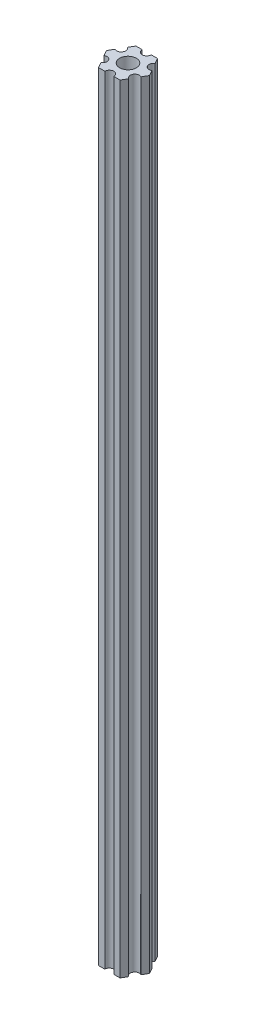
ISO-10303-21;
HEADER;
FILE_DESCRIPTION(('STEP AP214'),'2;1');
FILE_NAME('part.step','',(''),(''),'','','');
FILE_SCHEMA(('AUTOMOTIVE_DESIGN { 1 0 10303 214 1 1 1 1 }'));
ENDSEC;
DATA;
#1=APPLICATION_CONTEXT('core data for automotive mechanical design processes');
#2=APPLICATION_PROTOCOL_DEFINITION('international standard','automotive_design',2000,#1);
#3=PRODUCT_CONTEXT('',#1,'mechanical');
#4=PRODUCT('Part','Part','',(#3));
#5=PRODUCT_RELATED_PRODUCT_CATEGORY('part','',(#4));
#6=PRODUCT_DEFINITION_FORMATION('','',#4);
#7=PRODUCT_DEFINITION_CONTEXT('part definition',#1,'design');
#8=PRODUCT_DEFINITION('design','',#6,#7);
#9=PRODUCT_DEFINITION_SHAPE('','',#8);
#10=(LENGTH_UNIT() NAMED_UNIT(*) SI_UNIT(.MILLI.,.METRE.));
#11=(NAMED_UNIT(*) PLANE_ANGLE_UNIT() SI_UNIT($,.RADIAN.));
#12=(NAMED_UNIT(*) SI_UNIT($,.STERADIAN.) SOLID_ANGLE_UNIT());
#13=UNCERTAINTY_MEASURE_WITH_UNIT(LENGTH_MEASURE(1.E-05),#10,'distance_accuracy_value','');
#14=(GEOMETRIC_REPRESENTATION_CONTEXT(3) GLOBAL_UNCERTAINTY_ASSIGNED_CONTEXT((#13)) GLOBAL_UNIT_ASSIGNED_CONTEXT((#10,
#11,#12)) REPRESENTATION_CONTEXT('',''));
#15=CARTESIAN_POINT('',(0.,0.,0.));
#16=DIRECTION('',(0.,0.,1.));
#17=DIRECTION('',(1.,0.,0.));
#18=AXIS2_PLACEMENT_3D('',#15,#16,#17);
#19=CARTESIAN_POINT('',(5.41265877365274,-175.,3.125));
#20=DIRECTION('',(0.,1.,0.));
#21=DIRECTION('',(0.,0.,1.));
#22=AXIS2_PLACEMENT_3D('',#19,#20,#21);
#23=CYLINDRICAL_SURFACE('',#22,1.5);
#24=CARTESIAN_POINT('',(5.41265877365274,85.,3.125));
#25=DIRECTION('',(0.,-1.,0.));
#26=DIRECTION('',(0.,0.,-1.));
#27=AXIS2_PLACEMENT_3D('',#24,#25,#26);
#28=CIRCLE('',#27,1.5);
#29=CARTESIAN_POINT('',(4.66265877365274,85.,4.42403810567666));
#30=VERTEX_POINT('',#29);
#31=CARTESIAN_POINT('',(6.16265877365274,85.,1.82596189432335));
#32=VERTEX_POINT('',#31);
#33=EDGE_CURVE('E194',#30,#32,#28,.T.);
#34=ORIENTED_EDGE('',*,*,#33,.F.);
#35=DIRECTION('',(0.,1.,0.));
#36=VECTOR('',#35,1.);
#37=CARTESIAN_POINT('',(4.66265877365274,-175.,4.42403810567666));
#38=LINE('',#37,#36);
#39=CARTESIAN_POINT('',(4.66265877365274,-175.,4.42403810567666));
#40=VERTEX_POINT('',#39);
#41=EDGE_CURVE('E11',#40,#30,#38,.T.);
#42=ORIENTED_EDGE('',*,*,#41,.F.);
#43=CARTESIAN_POINT('',(5.41265877365274,-175.,3.125));
#44=DIRECTION('',(0.,-1.,0.));
#45=DIRECTION('',(0.,0.,-1.));
#46=AXIS2_PLACEMENT_3D('',#43,#44,#45);
#47=CIRCLE('',#46,1.5);
#48=CARTESIAN_POINT('',(6.16265877365274,-175.,1.82596189432335));
#49=VERTEX_POINT('',#48);
#50=EDGE_CURVE('E245',#40,#49,#47,.T.);
#51=ORIENTED_EDGE('',*,*,#50,.T.);
#52=DIRECTION('',(0.,1.,0.));
#53=VECTOR('',#52,1.);
#54=CARTESIAN_POINT('',(6.16265877365274,-175.,1.82596189432335));
#55=LINE('',#54,#53);
#56=EDGE_CURVE('E40',#49,#32,#55,.T.);
#57=ORIENTED_EDGE('',*,*,#56,.T.);
#58=EDGE_LOOP('',(#34,#42,#51,#57));
#59=FACE_BOUND('',#58,.T.);
#60=ADVANCED_FACE('F37',(#59),#23,.F.);
#61=CARTESIAN_POINT('',(3.60843918243516,-175.,6.25));
#62=DIRECTION('',(0.866025403784439,0.,0.5));
#63=DIRECTION('',(0.5,0.,-0.866025403784439));
#64=AXIS2_PLACEMENT_3D('',#61,#62,#63);
#65=PLANE('',#64);
#66=DIRECTION('',(0.5,0.,-0.866025403784439));
#67=VECTOR('',#66,1.);
#68=CARTESIAN_POINT('',(3.60843918243516,85.,6.25));
#69=LINE('',#68,#67);
#70=CARTESIAN_POINT('',(3.60843918243516,85.,6.25));
#71=VERTEX_POINT('',#70);
#72=EDGE_CURVE('E243',#71,#30,#69,.T.);
#73=ORIENTED_EDGE('',*,*,#72,.F.);
#74=DIRECTION('',(0.,1.,0.));
#75=VECTOR('',#74,1.);
#76=CARTESIAN_POINT('',(3.60843918243516,-175.,6.25));
#77=LINE('',#76,#75);
#78=CARTESIAN_POINT('',(3.60843918243516,-175.,6.25));
#79=VERTEX_POINT('',#78);
#80=EDGE_CURVE('E46',#79,#71,#77,.T.);
#81=ORIENTED_EDGE('',*,*,#80,.F.);
#82=DIRECTION('',(0.5,0.,-0.866025403784439));
#83=VECTOR('',#82,1.);
#84=CARTESIAN_POINT('',(3.60843918243516,-175.,6.25));
#85=LINE('',#84,#83);
#86=EDGE_CURVE('E184',#79,#40,#85,.T.);
#87=ORIENTED_EDGE('',*,*,#86,.T.);
#88=ORIENTED_EDGE('',*,*,#41,.T.);
#89=EDGE_LOOP('',(#73,#81,#87,#88));
#90=FACE_BOUND('',#89,.T.);
#91=ADVANCED_FACE('F277',(#90),#65,.T.);
#92=CARTESIAN_POINT('',(1.5,-175.,6.25));
#93=DIRECTION('',(0.,0.,1.));
#94=DIRECTION('',(1.,0.,0.));
#95=AXIS2_PLACEMENT_3D('',#92,#93,#94);
#96=PLANE('',#95);
#97=DIRECTION('',(1.,0.,0.));
#98=VECTOR('',#97,1.);
#99=CARTESIAN_POINT('',(1.5,85.,6.25));
#100=LINE('',#99,#98);
#101=CARTESIAN_POINT('',(1.5,85.,6.25));
#102=VERTEX_POINT('',#101);
#103=EDGE_CURVE('E171',#102,#71,#100,.T.);
#104=ORIENTED_EDGE('',*,*,#103,.F.);
#105=DIRECTION('',(0.,1.,0.));
#106=VECTOR('',#105,1.);
#107=CARTESIAN_POINT('',(1.5,-175.,6.25));
#108=LINE('',#107,#106);
#109=CARTESIAN_POINT('',(1.5,-175.,6.25));
#110=VERTEX_POINT('',#109);
#111=EDGE_CURVE('E166',#110,#102,#108,.T.);
#112=ORIENTED_EDGE('',*,*,#111,.F.);
#113=DIRECTION('',(1.,0.,0.));
#114=VECTOR('',#113,1.);
#115=CARTESIAN_POINT('',(1.5,-175.,6.25));
#116=LINE('',#115,#114);
#117=EDGE_CURVE('E169',#110,#79,#116,.T.);
#118=ORIENTED_EDGE('',*,*,#117,.T.);
#119=ORIENTED_EDGE('',*,*,#80,.T.);
#120=EDGE_LOOP('',(#104,#112,#118,#119));
#121=FACE_BOUND('',#120,.T.);
#122=ADVANCED_FACE('F168',(#121),#96,.T.);
#123=CARTESIAN_POINT('',(0.,-175.,6.25));
#124=DIRECTION('',(0.,1.,0.));
#125=DIRECTION('',(0.,0.,1.));
#126=AXIS2_PLACEMENT_3D('',#123,#124,#125);
#127=CYLINDRICAL_SURFACE('',#126,1.5);
#128=CARTESIAN_POINT('',(0.,85.,6.25));
#129=DIRECTION('',(0.,-1.,0.));
#130=DIRECTION('',(0.,0.,-1.));
#131=AXIS2_PLACEMENT_3D('',#128,#129,#130);
#132=CIRCLE('',#131,1.5);
#133=CARTESIAN_POINT('',(-1.5,85.,6.25));
#134=VERTEX_POINT('',#133);
#135=EDGE_CURVE('E240',#134,#102,#132,.T.);
#136=ORIENTED_EDGE('',*,*,#135,.F.);
#137=DIRECTION('',(0.,1.,0.));
#138=VECTOR('',#137,1.);
#139=CARTESIAN_POINT('',(-1.5,-175.,6.25));
#140=LINE('',#139,#138);
#141=CARTESIAN_POINT('',(-1.5,-175.,6.25));
#142=VERTEX_POINT('',#141);
#143=EDGE_CURVE('E176',#142,#134,#140,.T.);
#144=ORIENTED_EDGE('',*,*,#143,.F.);
#145=CARTESIAN_POINT('',(0.,-175.,6.25));
#146=DIRECTION('',(0.,-1.,0.));
#147=DIRECTION('',(0.,0.,-1.));
#148=AXIS2_PLACEMENT_3D('',#145,#146,#147);
#149=CIRCLE('',#148,1.5);
#150=EDGE_CURVE('E182',#142,#110,#149,.T.);
#151=ORIENTED_EDGE('',*,*,#150,.T.);
#152=ORIENTED_EDGE('',*,*,#111,.T.);
#153=EDGE_LOOP('',(#136,#144,#151,#152));
#154=FACE_BOUND('',#153,.T.);
#155=ADVANCED_FACE('F186',(#154),#127,.F.);
#156=CARTESIAN_POINT('',(-3.60843918243516,-175.,6.25));
#157=DIRECTION('',(0.,0.,1.));
#158=DIRECTION('',(1.,0.,0.));
#159=AXIS2_PLACEMENT_3D('',#156,#157,#158);
#160=PLANE('',#159);
#161=DIRECTION('',(1.,0.,0.));
#162=VECTOR('',#161,1.);
#163=CARTESIAN_POINT('',(-3.60843918243516,85.,6.25));
#164=LINE('',#163,#162);
#165=CARTESIAN_POINT('',(-3.60843918243516,85.,6.25));
#166=VERTEX_POINT('',#165);
#167=EDGE_CURVE('E237',#166,#134,#164,.T.);
#168=ORIENTED_EDGE('',*,*,#167,.F.);
#169=DIRECTION('',(0.,1.,0.));
#170=VECTOR('',#169,1.);
#171=CARTESIAN_POINT('',(-3.60843918243516,-175.,6.25));
#172=LINE('',#171,#170);
#173=CARTESIAN_POINT('',(-3.60843918243516,-175.,6.25));
#174=VERTEX_POINT('',#173);
#175=EDGE_CURVE('E249',#174,#166,#172,.T.);
#176=ORIENTED_EDGE('',*,*,#175,.F.);
#177=DIRECTION('',(1.,0.,0.));
#178=VECTOR('',#177,1.);
#179=CARTESIAN_POINT('',(-3.60843918243516,-175.,6.25));
#180=LINE('',#179,#178);
#181=EDGE_CURVE('E187',#174,#142,#180,.T.);
#182=ORIENTED_EDGE('',*,*,#181,.T.);
#183=ORIENTED_EDGE('',*,*,#143,.T.);
#184=EDGE_LOOP('',(#168,#176,#182,#183));
#185=FACE_BOUND('',#184,.T.);
#186=ADVANCED_FACE('F290',(#185),#160,.T.);
#187=CARTESIAN_POINT('',(-4.66265877365274,-175.,4.42403810567666));
#188=DIRECTION('',(-0.866025403784439,0.,0.5));
#189=DIRECTION('',(0.5,0.,0.866025403784439));
#190=AXIS2_PLACEMENT_3D('',#187,#188,#189);
#191=PLANE('',#190);
#192=DIRECTION('',(0.5,0.,0.866025403784439));
#193=VECTOR('',#192,1.);
#194=CARTESIAN_POINT('',(-4.66265877365274,85.,4.42403810567666));
#195=LINE('',#194,#193);
#196=CARTESIAN_POINT('',(-4.66265877365274,85.,4.42403810567666));
#197=VERTEX_POINT('',#196);
#198=EDGE_CURVE('E234',#197,#166,#195,.T.);
#199=ORIENTED_EDGE('',*,*,#198,.F.);
#200=DIRECTION('',(0.,1.,0.));
#201=VECTOR('',#200,1.);
#202=CARTESIAN_POINT('',(-4.66265877365274,-175.,4.42403810567666));
#203=LINE('',#202,#201);
#204=CARTESIAN_POINT('',(-4.66265877365274,-175.,4.42403810567666));
#205=VERTEX_POINT('',#204);
#206=EDGE_CURVE('E251',#205,#197,#203,.T.);
#207=ORIENTED_EDGE('',*,*,#206,.F.);
#208=DIRECTION('',(0.5,0.,0.866025403784439));
#209=VECTOR('',#208,1.);
#210=CARTESIAN_POINT('',(-4.66265877365274,-175.,4.42403810567666));
#211=LINE('',#210,#209);
#212=EDGE_CURVE('E189',#205,#174,#211,.T.);
#213=ORIENTED_EDGE('',*,*,#212,.T.);
#214=ORIENTED_EDGE('',*,*,#175,.T.);
#215=EDGE_LOOP('',(#199,#207,#213,#214));
#216=FACE_BOUND('',#215,.T.);
#217=ADVANCED_FACE('F293',(#216),#191,.T.);
#218=CARTESIAN_POINT('',(-5.41265877365274,-175.,3.125));
#219=DIRECTION('',(0.,1.,0.));
#220=DIRECTION('',(0.,0.,1.));
#221=AXIS2_PLACEMENT_3D('',#218,#219,#220);
#222=CYLINDRICAL_SURFACE('',#221,1.5);
#223=CARTESIAN_POINT('',(-5.41265877365274,85.,3.125));
#224=DIRECTION('',(0.,-1.,0.));
#225=DIRECTION('',(0.,0.,-1.));
#226=AXIS2_PLACEMENT_3D('',#223,#224,#225);
#227=CIRCLE('',#226,1.5);
#228=CARTESIAN_POINT('',(-6.16265877365274,85.,1.82596189432335));
#229=VERTEX_POINT('',#228);
#230=EDGE_CURVE('E231',#229,#197,#227,.T.);
#231=ORIENTED_EDGE('',*,*,#230,.F.);
#232=DIRECTION('',(0.,1.,0.));
#233=VECTOR('',#232,1.);
#234=CARTESIAN_POINT('',(-6.16265877365274,-175.,1.82596189432335));
#235=LINE('',#234,#233);
#236=CARTESIAN_POINT('',(-6.16265877365274,-175.,1.82596189432335));
#237=VERTEX_POINT('',#236);
#238=EDGE_CURVE('E253',#237,#229,#235,.T.);
#239=ORIENTED_EDGE('',*,*,#238,.F.);
#240=CARTESIAN_POINT('',(-5.41265877365274,-175.,3.125));
#241=DIRECTION('',(0.,-1.,0.));
#242=DIRECTION('',(0.,0.,-1.));
#243=AXIS2_PLACEMENT_3D('',#240,#241,#242);
#244=CIRCLE('',#243,1.5);
#245=EDGE_CURVE('E398',#237,#205,#244,.T.);
#246=ORIENTED_EDGE('',*,*,#245,.T.);
#247=ORIENTED_EDGE('',*,*,#206,.T.);
#248=EDGE_LOOP('',(#231,#239,#246,#247));
#249=FACE_BOUND('',#248,.T.);
#250=ADVANCED_FACE('F297',(#249),#222,.F.);
#251=CARTESIAN_POINT('',(-7.21687836487032,-175.,0.));
#252=DIRECTION('',(-0.866025403784439,0.,0.499999999999998));
#253=DIRECTION('',(0.499999999999998,0.,0.86602540378444));
#254=AXIS2_PLACEMENT_3D('',#251,#252,#253);
#255=PLANE('',#254);
#256=DIRECTION('',(0.499999999999998,0.,0.86602540378444));
#257=VECTOR('',#256,1.);
#258=CARTESIAN_POINT('',(-7.21687836487032,85.,0.));
#259=LINE('',#258,#257);
#260=CARTESIAN_POINT('',(-7.21687836487032,85.,0.));
#261=VERTEX_POINT('',#260);
#262=EDGE_CURVE('E228',#261,#229,#259,.T.);
#263=ORIENTED_EDGE('',*,*,#262,.F.);
#264=DIRECTION('',(0.,1.,0.));
#265=VECTOR('',#264,1.);
#266=CARTESIAN_POINT('',(-7.21687836487032,-175.,0.));
#267=LINE('',#266,#265);
#268=CARTESIAN_POINT('',(-7.21687836487032,-175.,0.));
#269=VERTEX_POINT('',#268);
#270=EDGE_CURVE('E255',#269,#261,#267,.T.);
#271=ORIENTED_EDGE('',*,*,#270,.F.);
#272=DIRECTION('',(0.499999999999998,0.,0.86602540378444));
#273=VECTOR('',#272,1.);
#274=CARTESIAN_POINT('',(-7.21687836487032,-175.,0.));
#275=LINE('',#274,#273);
#276=EDGE_CURVE('E395',#269,#237,#275,.T.);
#277=ORIENTED_EDGE('',*,*,#276,.T.);
#278=ORIENTED_EDGE('',*,*,#238,.T.);
#279=EDGE_LOOP('',(#263,#271,#277,#278));
#280=FACE_BOUND('',#279,.T.);
#281=ADVANCED_FACE('F301',(#280),#255,.T.);
#282=CARTESIAN_POINT('',(-6.16265877365274,-175.,-1.82596189432334));
#283=DIRECTION('',(-0.866025403784438,0.,-0.5));
#284=DIRECTION('',(-0.5,0.,0.866025403784438));
#285=AXIS2_PLACEMENT_3D('',#282,#283,#284);
#286=PLANE('',#285);
#287=DIRECTION('',(-0.5,0.,0.866025403784438));
#288=VECTOR('',#287,1.);
#289=CARTESIAN_POINT('',(-6.16265877365274,85.,-1.82596189432334));
#290=LINE('',#289,#288);
#291=CARTESIAN_POINT('',(-6.16265877365274,85.,-1.82596189432334));
#292=VERTEX_POINT('',#291);
#293=EDGE_CURVE('E225',#292,#261,#290,.T.);
#294=ORIENTED_EDGE('',*,*,#293,.F.);
#295=DIRECTION('',(0.,1.,0.));
#296=VECTOR('',#295,1.);
#297=CARTESIAN_POINT('',(-6.16265877365274,-175.,-1.82596189432334));
#298=LINE('',#297,#296);
#299=CARTESIAN_POINT('',(-6.16265877365274,-175.,-1.82596189432334));
#300=VERTEX_POINT('',#299);
#301=EDGE_CURVE('E257',#300,#292,#298,.T.);
#302=ORIENTED_EDGE('',*,*,#301,.F.);
#303=DIRECTION('',(-0.5,0.,0.866025403784438));
#304=VECTOR('',#303,1.);
#305=CARTESIAN_POINT('',(-6.16265877365274,-175.,-1.82596189432334));
#306=LINE('',#305,#304);
#307=EDGE_CURVE('E392',#300,#269,#306,.T.);
#308=ORIENTED_EDGE('',*,*,#307,.T.);
#309=ORIENTED_EDGE('',*,*,#270,.T.);
#310=EDGE_LOOP('',(#294,#302,#308,#309));
#311=FACE_BOUND('',#310,.T.);
#312=ADVANCED_FACE('F305',(#311),#286,.T.);
#313=CARTESIAN_POINT('',(-5.41265877365274,-175.,-3.125));
#314=DIRECTION('',(0.,1.,0.));
#315=DIRECTION('',(0.,0.,1.));
#316=AXIS2_PLACEMENT_3D('',#313,#314,#315);
#317=CYLINDRICAL_SURFACE('',#316,1.5);
#318=CARTESIAN_POINT('',(-5.41265877365274,85.,-3.125));
#319=DIRECTION('',(0.,-1.,0.));
#320=DIRECTION('',(0.,0.,-1.));
#321=AXIS2_PLACEMENT_3D('',#318,#319,#320);
#322=CIRCLE('',#321,1.5);
#323=CARTESIAN_POINT('',(-4.66265877365274,85.,-4.42403810567666));
#324=VERTEX_POINT('',#323);
#325=EDGE_CURVE('E222',#324,#292,#322,.T.);
#326=ORIENTED_EDGE('',*,*,#325,.F.);
#327=DIRECTION('',(0.,1.,0.));
#328=VECTOR('',#327,1.);
#329=CARTESIAN_POINT('',(-4.66265877365274,-175.,-4.42403810567666));
#330=LINE('',#329,#328);
#331=CARTESIAN_POINT('',(-4.66265877365274,-175.,-4.42403810567666));
#332=VERTEX_POINT('',#331);
#333=EDGE_CURVE('E259',#332,#324,#330,.T.);
#334=ORIENTED_EDGE('',*,*,#333,.F.);
#335=CARTESIAN_POINT('',(-5.41265877365274,-175.,-3.125));
#336=DIRECTION('',(0.,-1.,0.));
#337=DIRECTION('',(0.,0.,-1.));
#338=AXIS2_PLACEMENT_3D('',#335,#336,#337);
#339=CIRCLE('',#338,1.5);
#340=EDGE_CURVE('E389',#332,#300,#339,.T.);
#341=ORIENTED_EDGE('',*,*,#340,.T.);
#342=ORIENTED_EDGE('',*,*,#301,.T.);
#343=EDGE_LOOP('',(#326,#334,#341,#342));
#344=FACE_BOUND('',#343,.T.);
#345=ADVANCED_FACE('F309',(#344),#317,.F.);
#346=CARTESIAN_POINT('',(-3.60843918243516,-175.,-6.25));
#347=DIRECTION('',(-0.866025403784439,0.,-0.5));
#348=DIRECTION('',(-0.5,0.,0.866025403784439));
#349=AXIS2_PLACEMENT_3D('',#346,#347,#348);
#350=PLANE('',#349);
#351=DIRECTION('',(-0.5,0.,0.866025403784439));
#352=VECTOR('',#351,1.);
#353=CARTESIAN_POINT('',(-3.60843918243516,85.,-6.25));
#354=LINE('',#353,#352);
#355=CARTESIAN_POINT('',(-3.60843918243516,85.,-6.25));
#356=VERTEX_POINT('',#355);
#357=EDGE_CURVE('E219',#356,#324,#354,.T.);
#358=ORIENTED_EDGE('',*,*,#357,.F.);
#359=DIRECTION('',(0.,1.,0.));
#360=VECTOR('',#359,1.);
#361=CARTESIAN_POINT('',(-3.60843918243516,-175.,-6.25));
#362=LINE('',#361,#360);
#363=CARTESIAN_POINT('',(-3.60843918243516,-175.,-6.25));
#364=VERTEX_POINT('',#363);
#365=EDGE_CURVE('E261',#364,#356,#362,.T.);
#366=ORIENTED_EDGE('',*,*,#365,.F.);
#367=DIRECTION('',(-0.5,0.,0.866025403784439));
#368=VECTOR('',#367,1.);
#369=CARTESIAN_POINT('',(-3.60843918243516,-175.,-6.25));
#370=LINE('',#369,#368);
#371=EDGE_CURVE('E386',#364,#332,#370,.T.);
#372=ORIENTED_EDGE('',*,*,#371,.T.);
#373=ORIENTED_EDGE('',*,*,#333,.T.);
#374=EDGE_LOOP('',(#358,#366,#372,#373));
#375=FACE_BOUND('',#374,.T.);
#376=ADVANCED_FACE('F313',(#375),#350,.T.);
#377=CARTESIAN_POINT('',(-1.5,-175.,-6.25));
#378=DIRECTION('',(0.,0.,-1.));
#379=DIRECTION('',(-1.,0.,0.));
#380=AXIS2_PLACEMENT_3D('',#377,#378,#379);
#381=PLANE('',#380);
#382=DIRECTION('',(-1.,0.,0.));
#383=VECTOR('',#382,1.);
#384=CARTESIAN_POINT('',(-1.5,85.,-6.25));
#385=LINE('',#384,#383);
#386=CARTESIAN_POINT('',(-1.5,85.,-6.25));
#387=VERTEX_POINT('',#386);
#388=EDGE_CURVE('E216',#387,#356,#385,.T.);
#389=ORIENTED_EDGE('',*,*,#388,.F.);
#390=DIRECTION('',(0.,1.,0.));
#391=VECTOR('',#390,1.);
#392=CARTESIAN_POINT('',(-1.5,-175.,-6.25));
#393=LINE('',#392,#391);
#394=CARTESIAN_POINT('',(-1.5,-175.,-6.25));
#395=VERTEX_POINT('',#394);
#396=EDGE_CURVE('E263',#395,#387,#393,.T.);
#397=ORIENTED_EDGE('',*,*,#396,.F.);
#398=DIRECTION('',(-1.,0.,0.));
#399=VECTOR('',#398,1.);
#400=CARTESIAN_POINT('',(-1.5,-175.,-6.25));
#401=LINE('',#400,#399);
#402=EDGE_CURVE('E383',#395,#364,#401,.T.);
#403=ORIENTED_EDGE('',*,*,#402,.T.);
#404=ORIENTED_EDGE('',*,*,#365,.T.);
#405=EDGE_LOOP('',(#389,#397,#403,#404));
#406=FACE_BOUND('',#405,.T.);
#407=ADVANCED_FACE('F317',(#406),#381,.T.);
#408=CARTESIAN_POINT('',(0.,-175.,-6.25));
#409=DIRECTION('',(0.,1.,0.));
#410=DIRECTION('',(0.,0.,1.));
#411=AXIS2_PLACEMENT_3D('',#408,#409,#410);
#412=CYLINDRICAL_SURFACE('',#411,1.5);
#413=CARTESIAN_POINT('',(0.,85.,-6.25));
#414=DIRECTION('',(0.,-1.,0.));
#415=DIRECTION('',(0.,0.,-1.));
#416=AXIS2_PLACEMENT_3D('',#413,#414,#415);
#417=CIRCLE('',#416,1.5);
#418=CARTESIAN_POINT('',(1.5,85.,-6.25));
#419=VERTEX_POINT('',#418);
#420=EDGE_CURVE('E213',#419,#387,#417,.T.);
#421=ORIENTED_EDGE('',*,*,#420,.F.);
#422=DIRECTION('',(0.,1.,0.));
#423=VECTOR('',#422,1.);
#424=CARTESIAN_POINT('',(1.5,-175.,-6.25));
#425=LINE('',#424,#423);
#426=CARTESIAN_POINT('',(1.5,-175.,-6.25));
#427=VERTEX_POINT('',#426);
#428=EDGE_CURVE('E265',#427,#419,#425,.T.);
#429=ORIENTED_EDGE('',*,*,#428,.F.);
#430=CARTESIAN_POINT('',(0.,-175.,-6.25));
#431=DIRECTION('',(0.,-1.,0.));
#432=DIRECTION('',(0.,0.,-1.));
#433=AXIS2_PLACEMENT_3D('',#430,#431,#432);
#434=CIRCLE('',#433,1.5);
#435=EDGE_CURVE('E380',#427,#395,#434,.T.);
#436=ORIENTED_EDGE('',*,*,#435,.T.);
#437=ORIENTED_EDGE('',*,*,#396,.T.);
#438=EDGE_LOOP('',(#421,#429,#436,#437));
#439=FACE_BOUND('',#438,.T.);
#440=ADVANCED_FACE('F321',(#439),#412,.F.);
#441=CARTESIAN_POINT('',(3.60843918243516,-175.,-6.25));
#442=DIRECTION('',(0.,0.,-1.));
#443=DIRECTION('',(-1.,0.,0.));
#444=AXIS2_PLACEMENT_3D('',#441,#442,#443);
#445=PLANE('',#444);
#446=DIRECTION('',(-1.,0.,0.));
#447=VECTOR('',#446,1.);
#448=CARTESIAN_POINT('',(3.60843918243516,85.,-6.25));
#449=LINE('',#448,#447);
#450=CARTESIAN_POINT('',(3.60843918243516,85.,-6.25));
#451=VERTEX_POINT('',#450);
#452=EDGE_CURVE('E210',#451,#419,#449,.T.);
#453=ORIENTED_EDGE('',*,*,#452,.F.);
#454=DIRECTION('',(0.,1.,0.));
#455=VECTOR('',#454,1.);
#456=CARTESIAN_POINT('',(3.60843918243516,-175.,-6.25));
#457=LINE('',#456,#455);
#458=CARTESIAN_POINT('',(3.60843918243516,-175.,-6.25));
#459=VERTEX_POINT('',#458);
#460=EDGE_CURVE('E267',#459,#451,#457,.T.);
#461=ORIENTED_EDGE('',*,*,#460,.F.);
#462=DIRECTION('',(-1.,0.,0.));
#463=VECTOR('',#462,1.);
#464=CARTESIAN_POINT('',(3.60843918243516,-175.,-6.25));
#465=LINE('',#464,#463);
#466=EDGE_CURVE('E377',#459,#427,#465,.T.);
#467=ORIENTED_EDGE('',*,*,#466,.T.);
#468=ORIENTED_EDGE('',*,*,#428,.T.);
#469=EDGE_LOOP('',(#453,#461,#467,#468));
#470=FACE_BOUND('',#469,.T.);
#471=ADVANCED_FACE('F325',(#470),#445,.T.);
#472=CARTESIAN_POINT('',(4.66265877365274,-175.,-4.42403810567666));
#473=DIRECTION('',(0.866025403784439,0.,-0.5));
#474=DIRECTION('',(-0.5,0.,-0.866025403784439));
#475=AXIS2_PLACEMENT_3D('',#472,#473,#474);
#476=PLANE('',#475);
#477=DIRECTION('',(-0.5,0.,-0.866025403784439));
#478=VECTOR('',#477,1.);
#479=CARTESIAN_POINT('',(4.66265877365274,85.,-4.42403810567666));
#480=LINE('',#479,#478);
#481=CARTESIAN_POINT('',(4.66265877365274,85.,-4.42403810567666));
#482=VERTEX_POINT('',#481);
#483=EDGE_CURVE('E207',#482,#451,#480,.T.);
#484=ORIENTED_EDGE('',*,*,#483,.F.);
#485=DIRECTION('',(0.,1.,0.));
#486=VECTOR('',#485,1.);
#487=CARTESIAN_POINT('',(4.66265877365274,-175.,-4.42403810567666));
#488=LINE('',#487,#486);
#489=CARTESIAN_POINT('',(4.66265877365274,-175.,-4.42403810567666));
#490=VERTEX_POINT('',#489);
#491=EDGE_CURVE('E269',#490,#482,#488,.T.);
#492=ORIENTED_EDGE('',*,*,#491,.F.);
#493=DIRECTION('',(-0.5,0.,-0.866025403784439));
#494=VECTOR('',#493,1.);
#495=CARTESIAN_POINT('',(4.66265877365274,-175.,-4.42403810567666));
#496=LINE('',#495,#494);
#497=EDGE_CURVE('E374',#490,#459,#496,.T.);
#498=ORIENTED_EDGE('',*,*,#497,.T.);
#499=ORIENTED_EDGE('',*,*,#460,.T.);
#500=EDGE_LOOP('',(#484,#492,#498,#499));
#501=FACE_BOUND('',#500,.T.);
#502=ADVANCED_FACE('F329',(#501),#476,.T.);
#503=CARTESIAN_POINT('',(5.41265877365274,-175.,-3.125));
#504=DIRECTION('',(0.,1.,0.));
#505=DIRECTION('',(0.,0.,1.));
#506=AXIS2_PLACEMENT_3D('',#503,#504,#505);
#507=CYLINDRICAL_SURFACE('',#506,1.5);
#508=CARTESIAN_POINT('',(5.41265877365274,85.,-3.125));
#509=DIRECTION('',(0.,-1.,0.));
#510=DIRECTION('',(0.,0.,-1.));
#511=AXIS2_PLACEMENT_3D('',#508,#509,#510);
#512=CIRCLE('',#511,1.5);
#513=CARTESIAN_POINT('',(6.16265877365274,85.,-1.82596189432334));
#514=VERTEX_POINT('',#513);
#515=EDGE_CURVE('E204',#514,#482,#512,.T.);
#516=ORIENTED_EDGE('',*,*,#515,.F.);
#517=DIRECTION('',(0.,1.,0.));
#518=VECTOR('',#517,1.);
#519=CARTESIAN_POINT('',(6.16265877365274,-175.,-1.82596189432334));
#520=LINE('',#519,#518);
#521=CARTESIAN_POINT('',(6.16265877365274,-175.,-1.82596189432334));
#522=VERTEX_POINT('',#521);
#523=EDGE_CURVE('E271',#522,#514,#520,.T.);
#524=ORIENTED_EDGE('',*,*,#523,.F.);
#525=CARTESIAN_POINT('',(5.41265877365274,-175.,-3.125));
#526=DIRECTION('',(0.,-1.,0.));
#527=DIRECTION('',(0.,0.,-1.));
#528=AXIS2_PLACEMENT_3D('',#525,#526,#527);
#529=CIRCLE('',#528,1.5);
#530=EDGE_CURVE('E371',#522,#490,#529,.T.);
#531=ORIENTED_EDGE('',*,*,#530,.T.);
#532=ORIENTED_EDGE('',*,*,#491,.T.);
#533=EDGE_LOOP('',(#516,#524,#531,#532));
#534=FACE_BOUND('',#533,.T.);
#535=ADVANCED_FACE('F333',(#534),#507,.F.);
#536=CARTESIAN_POINT('',(7.21687836487032,-175.,0.));
#537=DIRECTION('',(0.866025403784438,0.,-0.5));
#538=DIRECTION('',(-0.5,0.,-0.866025403784439));
#539=AXIS2_PLACEMENT_3D('',#536,#537,#538);
#540=PLANE('',#539);
#541=DIRECTION('',(-0.5,0.,-0.866025403784439));
#542=VECTOR('',#541,1.);
#543=CARTESIAN_POINT('',(7.21687836487032,85.,0.));
#544=LINE('',#543,#542);
#545=CARTESIAN_POINT('',(7.21687836487032,85.,0.));
#546=VERTEX_POINT('',#545);
#547=EDGE_CURVE('E201',#546,#514,#544,.T.);
#548=ORIENTED_EDGE('',*,*,#547,.F.);
#549=DIRECTION('',(0.,1.,0.));
#550=VECTOR('',#549,1.);
#551=CARTESIAN_POINT('',(7.21687836487032,-175.,0.));
#552=LINE('',#551,#550);
#553=CARTESIAN_POINT('',(7.21687836487032,-175.,0.));
#554=VERTEX_POINT('',#553);
#555=EDGE_CURVE('E272',#554,#546,#552,.T.);
#556=ORIENTED_EDGE('',*,*,#555,.F.);
#557=DIRECTION('',(-0.5,0.,-0.866025403784439));
#558=VECTOR('',#557,1.);
#559=CARTESIAN_POINT('',(7.21687836487032,-175.,0.));
#560=LINE('',#559,#558);
#561=EDGE_CURVE('E368',#554,#522,#560,.T.);
#562=ORIENTED_EDGE('',*,*,#561,.T.);
#563=ORIENTED_EDGE('',*,*,#523,.T.);
#564=EDGE_LOOP('',(#548,#556,#562,#563));
#565=FACE_BOUND('',#564,.T.);
#566=ADVANCED_FACE('F337',(#565),#540,.T.);
#567=CARTESIAN_POINT('',(6.16265877365274,-175.,1.82596189432335));
#568=DIRECTION('',(0.866025403784439,0.,0.499999999999999));
#569=DIRECTION('',(0.499999999999999,0.,-0.866025403784439));
#570=AXIS2_PLACEMENT_3D('',#567,#568,#569);
#571=PLANE('',#570);
#572=DIRECTION('',(0.499999999999999,0.,-0.86602540378444));
#573=VECTOR('',#572,1.);
#574=CARTESIAN_POINT('',(6.16265877365274,85.,1.82596189432335));
#575=LINE('',#574,#573);
#576=EDGE_CURVE('E197',#32,#546,#575,.T.);
#577=ORIENTED_EDGE('',*,*,#576,.F.);
#578=ORIENTED_EDGE('',*,*,#56,.F.);
#579=DIRECTION('',(0.499999999999999,0.,-0.86602540378444));
#580=VECTOR('',#579,1.);
#581=CARTESIAN_POINT('',(6.16265877365274,-175.,1.82596189432335));
#582=LINE('',#581,#580);
#583=EDGE_CURVE('E366',#49,#554,#582,.T.);
#584=ORIENTED_EDGE('',*,*,#583,.T.);
#585=ORIENTED_EDGE('',*,*,#555,.T.);
#586=EDGE_LOOP('',(#577,#578,#584,#585));
#587=FACE_BOUND('',#586,.T.);
#588=ADVANCED_FACE('F274',(#587),#571,.T.);
#589=CARTESIAN_POINT('',(5.41265877365274,-175.,3.125));
#590=DIRECTION('',(0.,-1.,0.));
#591=DIRECTION('',(0.,0.,-1.));
#592=AXIS2_PLACEMENT_3D('',#589,#590,#591);
#593=PLANE('',#592);
#594=CARTESIAN_POINT('',(0.,-175.,0.));
#595=DIRECTION('',(0.,1.,0.));
#596=DIRECTION('',(0.,0.,-1.));
#597=AXIS2_PLACEMENT_3D('',#594,#595,#596);
#598=CIRCLE('',#597,2.79);
#599=CARTESIAN_POINT('',(0.,-175.,-2.79));
#600=VERTEX_POINT('',#599);
#601=EDGE_CURVE('E198',#600,#600,#598,.T.);
#602=ORIENTED_EDGE('',*,*,#601,.T.);
#603=EDGE_LOOP('',(#602));
#604=FACE_BOUND('',#603,.T.);
#605=ORIENTED_EDGE('',*,*,#50,.F.);
#606=ORIENTED_EDGE('',*,*,#86,.F.);
#607=ORIENTED_EDGE('',*,*,#117,.F.);
#608=ORIENTED_EDGE('',*,*,#150,.F.);
#609=ORIENTED_EDGE('',*,*,#181,.F.);
#610=ORIENTED_EDGE('',*,*,#212,.F.);
#611=ORIENTED_EDGE('',*,*,#245,.F.);
#612=ORIENTED_EDGE('',*,*,#276,.F.);
#613=ORIENTED_EDGE('',*,*,#307,.F.);
#614=ORIENTED_EDGE('',*,*,#340,.F.);
#615=ORIENTED_EDGE('',*,*,#371,.F.);
#616=ORIENTED_EDGE('',*,*,#402,.F.);
#617=ORIENTED_EDGE('',*,*,#435,.F.);
#618=ORIENTED_EDGE('',*,*,#466,.F.);
#619=ORIENTED_EDGE('',*,*,#497,.F.);
#620=ORIENTED_EDGE('',*,*,#530,.F.);
#621=ORIENTED_EDGE('',*,*,#561,.F.);
#622=ORIENTED_EDGE('',*,*,#583,.F.);
#623=EDGE_LOOP('',(#605,#606,#607,#608,#609,#610,#611,#612,#613,#614,#615,#616,#617,#618,#619,
#620,#621,#622));
#624=FACE_BOUND('',#623,.T.);
#625=ADVANCED_FACE('F180',(#604,#624),#593,.T.);
#626=CARTESIAN_POINT('',(5.41265877365274,85.,3.125));
#627=DIRECTION('',(0.,-1.,0.));
#628=DIRECTION('',(0.,0.,-1.));
#629=AXIS2_PLACEMENT_3D('',#626,#627,#628);
#630=PLANE('',#629);
#631=CARTESIAN_POINT('',(0.,85.,0.));
#632=DIRECTION('',(0.,1.,0.));
#633=DIRECTION('',(0.,0.,-1.));
#634=AXIS2_PLACEMENT_3D('',#631,#632,#633);
#635=CIRCLE('',#634,2.79);
#636=CARTESIAN_POINT('',(0.,85.,-2.79));
#637=VERTEX_POINT('',#636);
#638=EDGE_CURVE('E361',#637,#637,#635,.T.);
#639=ORIENTED_EDGE('',*,*,#638,.F.);
#640=EDGE_LOOP('',(#639));
#641=FACE_BOUND('',#640,.T.);
#642=ORIENTED_EDGE('',*,*,#33,.T.);
#643=ORIENTED_EDGE('',*,*,#576,.T.);
#644=ORIENTED_EDGE('',*,*,#547,.T.);
#645=ORIENTED_EDGE('',*,*,#515,.T.);
#646=ORIENTED_EDGE('',*,*,#483,.T.);
#647=ORIENTED_EDGE('',*,*,#452,.T.);
#648=ORIENTED_EDGE('',*,*,#420,.T.);
#649=ORIENTED_EDGE('',*,*,#388,.T.);
#650=ORIENTED_EDGE('',*,*,#357,.T.);
#651=ORIENTED_EDGE('',*,*,#325,.T.);
#652=ORIENTED_EDGE('',*,*,#293,.T.);
#653=ORIENTED_EDGE('',*,*,#262,.T.);
#654=ORIENTED_EDGE('',*,*,#230,.T.);
#655=ORIENTED_EDGE('',*,*,#198,.T.);
#656=ORIENTED_EDGE('',*,*,#167,.T.);
#657=ORIENTED_EDGE('',*,*,#135,.T.);
#658=ORIENTED_EDGE('',*,*,#103,.T.);
#659=ORIENTED_EDGE('',*,*,#72,.T.);
#660=EDGE_LOOP('',(#642,#643,#644,#645,#646,#647,#648,#649,#650,#651,#652,#653,#654,#655,#656,
#657,#658,#659));
#661=FACE_BOUND('',#660,.T.);
#662=ADVANCED_FACE('F276',(#641,#661),#630,.F.);
#663=CARTESIAN_POINT('',(0.,-175.,0.));
#664=DIRECTION('',(0.,1.,0.));
#665=DIRECTION('',(0.,0.,1.));
#666=AXIS2_PLACEMENT_3D('',#663,#664,#665);
#667=CYLINDRICAL_SURFACE('',#666,2.79);
#668=ORIENTED_EDGE('',*,*,#601,.F.);
#669=EDGE_LOOP('',(#668));
#670=FACE_BOUND('',#669,.T.);
#671=ORIENTED_EDGE('',*,*,#638,.T.);
#672=EDGE_LOOP('',(#671));
#673=FACE_BOUND('',#672,.T.);
#674=ADVANCED_FACE('F349',(#670,#673),#667,.F.);
#675=CLOSED_SHELL('',(#60,#91,#122,#155,#186,#217,#250,#281,#312,#345,#376,#407,#440,#471,#502,
#535,#566,#588,#625,#662,#674));
#676=MANIFOLD_SOLID_BREP('B2',#675);
#677=ADVANCED_BREP_SHAPE_REPRESENTATION('',(#18,#676),#14);
#678=SHAPE_DEFINITION_REPRESENTATION(#9,#677);
ENDSEC;
END-ISO-10303-21;
